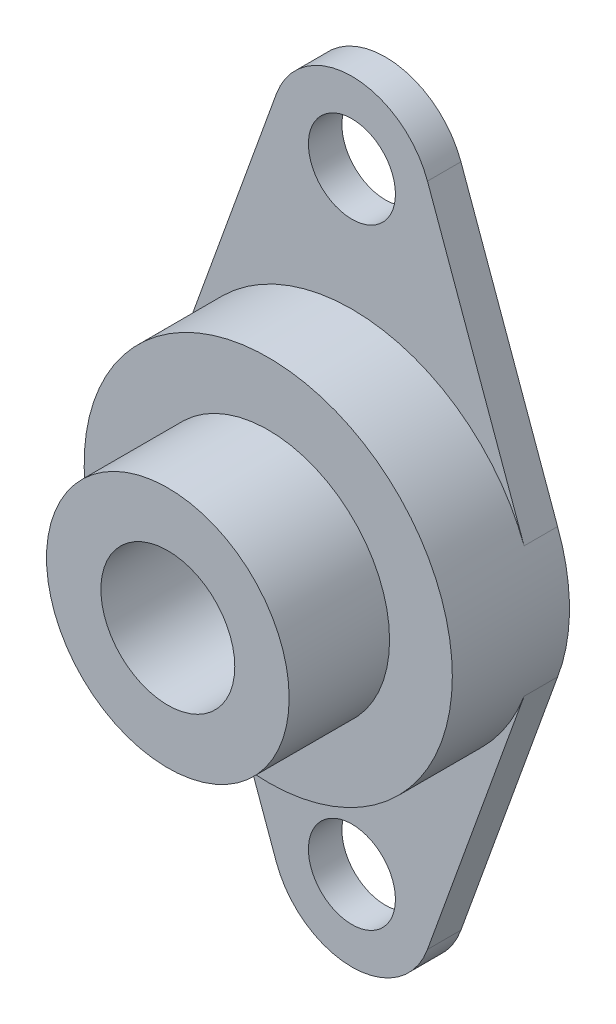
ISO-10303-21;
HEADER;
FILE_DESCRIPTION(('STEP AP214'),'2;1');
FILE_NAME('part.step','',(''),(''),'','','');
FILE_SCHEMA(('AUTOMOTIVE_DESIGN { 1 0 10303 214 1 1 1 1 }'));
ENDSEC;
DATA;
#1=APPLICATION_CONTEXT('core data for automotive mechanical design processes');
#2=APPLICATION_PROTOCOL_DEFINITION('international standard','automotive_design',2000,#1);
#3=PRODUCT_CONTEXT('',#1,'mechanical');
#4=PRODUCT('Part','Part','',(#3));
#5=PRODUCT_RELATED_PRODUCT_CATEGORY('part','',(#4));
#6=PRODUCT_DEFINITION_FORMATION('','',#4);
#7=PRODUCT_DEFINITION_CONTEXT('part definition',#1,'design');
#8=PRODUCT_DEFINITION('design','',#6,#7);
#9=PRODUCT_DEFINITION_SHAPE('','',#8);
#10=(LENGTH_UNIT() NAMED_UNIT(*) SI_UNIT(.MILLI.,.METRE.));
#11=(NAMED_UNIT(*) PLANE_ANGLE_UNIT() SI_UNIT($,.RADIAN.));
#12=(NAMED_UNIT(*) SI_UNIT($,.STERADIAN.) SOLID_ANGLE_UNIT());
#13=UNCERTAINTY_MEASURE_WITH_UNIT(LENGTH_MEASURE(1.E-05),#10,'distance_accuracy_value','');
#14=(GEOMETRIC_REPRESENTATION_CONTEXT(3) GLOBAL_UNCERTAINTY_ASSIGNED_CONTEXT((#13)) GLOBAL_UNIT_ASSIGNED_CONTEXT((#10,
#11,#12)) REPRESENTATION_CONTEXT('',''));
#15=CARTESIAN_POINT('',(0.,0.,0.));
#16=DIRECTION('',(0.,0.,1.));
#17=DIRECTION('',(1.,0.,0.));
#18=AXIS2_PLACEMENT_3D('',#15,#16,#17);
#19=CARTESIAN_POINT('',(0.,0.,7.));
#20=DIRECTION('',(0.,0.,1.));
#21=DIRECTION('',(1.,0.,0.));
#22=AXIS2_PLACEMENT_3D('',#19,#20,#21);
#23=PLANE('',#22);
#24=CARTESIAN_POINT('',(0.,0.,7.));
#25=DIRECTION('',(0.,0.,1.));
#26=DIRECTION('',(1.,0.,0.));
#27=AXIS2_PLACEMENT_3D('',#24,#25,#26);
#28=CIRCLE('',#27,11.);
#29=CARTESIAN_POINT('',(11.,0.,7.));
#30=VERTEX_POINT('',#29);
#31=EDGE_CURVE('E172',#30,#30,#28,.T.);
#32=ORIENTED_EDGE('',*,*,#31,.T.);
#33=EDGE_LOOP('',(#32));
#34=FACE_BOUND('',#33,.T.);
#35=CARTESIAN_POINT('',(0.,0.,7.));
#36=DIRECTION('',(0.,0.,1.));
#37=DIRECTION('',(1.,0.,0.));
#38=AXIS2_PLACEMENT_3D('',#35,#36,#37);
#39=CIRCLE('',#38,7.25);
#40=CARTESIAN_POINT('',(7.25,0.,7.));
#41=VERTEX_POINT('',#40);
#42=EDGE_CURVE('E207',#41,#41,#39,.T.);
#43=ORIENTED_EDGE('',*,*,#42,.F.);
#44=EDGE_LOOP('',(#43));
#45=FACE_BOUND('',#44,.T.);
#46=ADVANCED_FACE('F40',(#34,#45),#23,.T.);
#47=CARTESIAN_POINT('',(-4.51463490773956,-19.8803593621712,7.));
#48=DIRECTION('',(0.940548939112409,0.339658200452339,0.));
#49=DIRECTION('',(-0.339658200452339,0.940548939112409,0.));
#50=AXIS2_PLACEMENT_3D('',#47,#48,#49);
#51=PLANE('',#50);
#52=DIRECTION('',(0.339658200452339,-0.940548939112409,0.));
#53=VECTOR('',#52,1.);
#54=CARTESIAN_POINT('',(-10.3448740794966,-3.73581976187625,2.));
#55=LINE('',#54,#53);
#56=CARTESIAN_POINT('',(-10.2888243154293,-3.89102739726029,2.));
#57=VERTEX_POINT('',#56);
#58=CARTESIAN_POINT('',(-4.51463490773956,-19.8803593621712,2.));
#59=VERTEX_POINT('',#58);
#60=EDGE_CURVE('E198',#57,#59,#55,.T.);
#61=ORIENTED_EDGE('',*,*,#60,.F.);
#62=DIRECTION('',(0.,0.,-1.));
#63=VECTOR('',#62,1.);
#64=CARTESIAN_POINT('',(-10.2888243154293,-3.89102739726029,7.));
#65=LINE('',#64,#63);
#66=CARTESIAN_POINT('',(-10.2888243154293,-3.89102739726029,0.));
#67=VERTEX_POINT('',#66);
#68=EDGE_CURVE('E11',#57,#67,#65,.T.);
#69=ORIENTED_EDGE('',*,*,#68,.T.);
#70=DIRECTION('',(0.339658200452339,-0.940548939112409,0.));
#71=VECTOR('',#70,1.);
#72=CARTESIAN_POINT('',(-4.51463490773956,-19.8803593621712,0.));
#73=LINE('',#72,#71);
#74=CARTESIAN_POINT('',(-4.51463490773956,-19.8803593621712,0.));
#75=VERTEX_POINT('',#74);
#76=EDGE_CURVE('E149',#67,#75,#73,.T.);
#77=ORIENTED_EDGE('',*,*,#76,.T.);
#78=DIRECTION('',(0.,0.,-1.));
#79=VECTOR('',#78,1.);
#80=CARTESIAN_POINT('',(-4.51463490773956,-19.8803593621712,7.));
#81=LINE('',#80,#79);
#82=EDGE_CURVE('E48',#59,#75,#81,.T.);
#83=ORIENTED_EDGE('',*,*,#82,.F.);
#84=EDGE_LOOP('',(#61,#69,#77,#83));
#85=FACE_BOUND('',#84,.T.);
#86=ADVANCED_FACE('F42',(#85),#51,.F.);
#87=CARTESIAN_POINT('',(0.,-18.25,7.));
#88=DIRECTION('',(0.,0.,-1.));
#89=DIRECTION('',(-1.,0.,0.));
#90=AXIS2_PLACEMENT_3D('',#87,#88,#89);
#91=CYLINDRICAL_SURFACE('',#90,4.8);
#92=CARTESIAN_POINT('',(0.,-18.25,2.));
#93=DIRECTION('',(0.,0.,1.));
#94=DIRECTION('',(1.,0.,0.));
#95=AXIS2_PLACEMENT_3D('',#92,#93,#94);
#96=CIRCLE('',#95,4.8);
#97=CARTESIAN_POINT('',(4.51463490773956,-19.8803593621713,2.));
#98=VERTEX_POINT('',#97);
#99=EDGE_CURVE('E145',#59,#98,#96,.T.);
#100=ORIENTED_EDGE('',*,*,#99,.F.);
#101=ORIENTED_EDGE('',*,*,#82,.T.);
#102=CARTESIAN_POINT('',(0.,-18.25,0.));
#103=DIRECTION('',(0.,0.,1.));
#104=DIRECTION('',(-1.,0.,0.));
#105=AXIS2_PLACEMENT_3D('',#102,#103,#104);
#106=CIRCLE('',#105,4.8);
#107=CARTESIAN_POINT('',(4.51463490773956,-19.8803593621712,0.));
#108=VERTEX_POINT('',#107);
#109=EDGE_CURVE('E143',#75,#108,#106,.T.);
#110=ORIENTED_EDGE('',*,*,#109,.T.);
#111=DIRECTION('',(0.,0.,-1.));
#112=VECTOR('',#111,1.);
#113=CARTESIAN_POINT('',(4.51463490773956,-19.8803593621712,7.));
#114=LINE('',#113,#112);
#115=EDGE_CURVE('E129',#98,#108,#114,.T.);
#116=ORIENTED_EDGE('',*,*,#115,.F.);
#117=EDGE_LOOP('',(#100,#101,#110,#116));
#118=FACE_BOUND('',#117,.T.);
#119=ADVANCED_FACE('F140',(#118),#91,.T.);
#120=CARTESIAN_POINT('',(10.2888243154293,-3.89102739726029,7.));
#121=DIRECTION('',(-0.940548939112409,0.339658200452339,0.));
#122=DIRECTION('',(-0.339658200452339,-0.940548939112409,0.));
#123=AXIS2_PLACEMENT_3D('',#120,#121,#122);
#124=PLANE('',#123);
#125=DIRECTION('',(0.339658200452339,0.940548939112409,0.));
#126=VECTOR('',#125,1.);
#127=CARTESIAN_POINT('',(10.3448740794966,-3.73581976187625,2.));
#128=LINE('',#127,#126);
#129=CARTESIAN_POINT('',(10.2888243154293,-3.89102739726029,2.));
#130=VERTEX_POINT('',#129);
#131=EDGE_CURVE('E55',#98,#130,#128,.T.);
#132=ORIENTED_EDGE('',*,*,#131,.F.);
#133=ORIENTED_EDGE('',*,*,#115,.T.);
#134=DIRECTION('',(0.339658200452339,0.940548939112409,0.));
#135=VECTOR('',#134,1.);
#136=CARTESIAN_POINT('',(10.2888243154293,-3.89102739726029,0.));
#137=LINE('',#136,#135);
#138=CARTESIAN_POINT('',(10.2888243154293,-3.89102739726029,0.));
#139=VERTEX_POINT('',#138);
#140=EDGE_CURVE('E158',#108,#139,#137,.T.);
#141=ORIENTED_EDGE('',*,*,#140,.T.);
#142=DIRECTION('',(0.,0.,-1.));
#143=VECTOR('',#142,1.);
#144=CARTESIAN_POINT('',(10.2888243154293,-3.89102739726029,7.));
#145=LINE('',#144,#143);
#146=EDGE_CURVE('E127',#130,#139,#145,.T.);
#147=ORIENTED_EDGE('',*,*,#146,.F.);
#148=EDGE_LOOP('',(#132,#133,#141,#147));
#149=FACE_BOUND('',#148,.T.);
#150=ADVANCED_FACE('F251',(#149),#124,.F.);
#151=CARTESIAN_POINT('',(4.51463490773956,19.8803593621712,7.));
#152=DIRECTION('',(-0.940548939112409,-0.339658200452339,0.));
#153=DIRECTION('',(0.33965820045234,-0.940548939112409,0.));
#154=AXIS2_PLACEMENT_3D('',#151,#152,#153);
#155=PLANE('',#154);
#156=DIRECTION('',(-0.339658200452339,0.940548939112409,0.));
#157=VECTOR('',#156,1.);
#158=CARTESIAN_POINT('',(10.3448740794966,3.73581976187625,2.));
#159=LINE('',#158,#157);
#160=CARTESIAN_POINT('',(10.2888243154293,3.8910273972603,2.));
#161=VERTEX_POINT('',#160);
#162=CARTESIAN_POINT('',(4.51463490773955,19.8803593621712,2.));
#163=VERTEX_POINT('',#162);
#164=EDGE_CURVE('E106',#161,#163,#159,.T.);
#165=ORIENTED_EDGE('',*,*,#164,.F.);
#166=DIRECTION('',(0.,0.,-1.));
#167=VECTOR('',#166,1.);
#168=CARTESIAN_POINT('',(10.2888243154293,3.89102739726029,7.));
#169=LINE('',#168,#167);
#170=CARTESIAN_POINT('',(10.2888243154293,3.89102739726029,0.));
#171=VERTEX_POINT('',#170);
#172=EDGE_CURVE('E117',#161,#171,#169,.T.);
#173=ORIENTED_EDGE('',*,*,#172,.T.);
#174=DIRECTION('',(-0.339658200452339,0.940548939112409,0.));
#175=VECTOR('',#174,1.);
#176=CARTESIAN_POINT('',(4.51463490773956,19.8803593621712,0.));
#177=LINE('',#176,#175);
#178=CARTESIAN_POINT('',(4.51463490773956,19.8803593621712,0.));
#179=VERTEX_POINT('',#178);
#180=EDGE_CURVE('E164',#171,#179,#177,.T.);
#181=ORIENTED_EDGE('',*,*,#180,.T.);
#182=DIRECTION('',(0.,0.,-1.));
#183=VECTOR('',#182,1.);
#184=CARTESIAN_POINT('',(4.51463490773956,19.8803593621712,7.));
#185=LINE('',#184,#183);
#186=EDGE_CURVE('E119',#163,#179,#185,.T.);
#187=ORIENTED_EDGE('',*,*,#186,.F.);
#188=EDGE_LOOP('',(#165,#173,#181,#187));
#189=FACE_BOUND('',#188,.T.);
#190=ADVANCED_FACE('F115',(#189),#155,.F.);
#191=CARTESIAN_POINT('',(0.,18.25,7.));
#192=DIRECTION('',(0.,0.,-1.));
#193=DIRECTION('',(-1.,0.,0.));
#194=AXIS2_PLACEMENT_3D('',#191,#192,#193);
#195=CYLINDRICAL_SURFACE('',#194,4.8);
#196=CARTESIAN_POINT('',(0.,18.25,2.));
#197=DIRECTION('',(0.,0.,1.));
#198=DIRECTION('',(1.,0.,0.));
#199=AXIS2_PLACEMENT_3D('',#196,#197,#198);
#200=CIRCLE('',#199,4.8);
#201=CARTESIAN_POINT('',(-4.51463490773957,19.8803593621712,2.));
#202=VERTEX_POINT('',#201);
#203=EDGE_CURVE('E63',#163,#202,#200,.T.);
#204=ORIENTED_EDGE('',*,*,#203,.F.);
#205=ORIENTED_EDGE('',*,*,#186,.T.);
#206=CARTESIAN_POINT('',(0.,18.25,0.));
#207=DIRECTION('',(0.,0.,1.));
#208=DIRECTION('',(1.,0.,0.));
#209=AXIS2_PLACEMENT_3D('',#206,#207,#208);
#210=CIRCLE('',#209,4.8);
#211=CARTESIAN_POINT('',(-4.51463490773957,19.8803593621712,0.));
#212=VERTEX_POINT('',#211);
#213=EDGE_CURVE('E166',#179,#212,#210,.T.);
#214=ORIENTED_EDGE('',*,*,#213,.T.);
#215=DIRECTION('',(0.,0.,-1.));
#216=VECTOR('',#215,1.);
#217=CARTESIAN_POINT('',(-4.51463490773957,19.8803593621712,7.));
#218=LINE('',#217,#216);
#219=EDGE_CURVE('E131',#202,#212,#218,.T.);
#220=ORIENTED_EDGE('',*,*,#219,.F.);
#221=EDGE_LOOP('',(#204,#205,#214,#220));
#222=FACE_BOUND('',#221,.T.);
#223=ADVANCED_FACE('F180',(#222),#195,.T.);
#224=CARTESIAN_POINT('',(-4.51463490773956,19.8803593621712,7.));
#225=DIRECTION('',(0.940548939112409,-0.339658200452339,0.));
#226=DIRECTION('',(0.33965820045234,0.940548939112409,0.));
#227=AXIS2_PLACEMENT_3D('',#224,#225,#226);
#228=PLANE('',#227);
#229=DIRECTION('',(-0.339658200452339,-0.940548939112409,0.));
#230=VECTOR('',#229,1.);
#231=CARTESIAN_POINT('',(-10.3448740794966,3.73581976187625,2.));
#232=LINE('',#231,#230);
#233=CARTESIAN_POINT('',(-10.2888243154293,3.8910273972603,2.));
#234=VERTEX_POINT('',#233);
#235=EDGE_CURVE('E107',#202,#234,#232,.T.);
#236=ORIENTED_EDGE('',*,*,#235,.F.);
#237=ORIENTED_EDGE('',*,*,#219,.T.);
#238=DIRECTION('',(-0.339658200452339,-0.940548939112409,0.));
#239=VECTOR('',#238,1.);
#240=CARTESIAN_POINT('',(-4.51463490773956,19.8803593621712,0.));
#241=LINE('',#240,#239);
#242=CARTESIAN_POINT('',(-10.2888243154293,3.89102739726029,0.));
#243=VERTEX_POINT('',#242);
#244=EDGE_CURVE('E169',#212,#243,#241,.T.);
#245=ORIENTED_EDGE('',*,*,#244,.T.);
#246=DIRECTION('',(0.,0.,-1.));
#247=VECTOR('',#246,1.);
#248=CARTESIAN_POINT('',(-10.2888243154293,3.89102739726029,7.));
#249=LINE('',#248,#247);
#250=EDGE_CURVE('E173',#234,#243,#249,.T.);
#251=ORIENTED_EDGE('',*,*,#250,.F.);
#252=EDGE_LOOP('',(#236,#237,#245,#251));
#253=FACE_BOUND('',#252,.T.);
#254=ADVANCED_FACE('F176',(#253),#228,.F.);
#255=CARTESIAN_POINT('',(0.,-18.25,7.));
#256=DIRECTION('',(0.,0.,-1.));
#257=DIRECTION('',(-1.,0.,0.));
#258=AXIS2_PLACEMENT_3D('',#255,#256,#257);
#259=CYLINDRICAL_SURFACE('',#258,2.6);
#260=CARTESIAN_POINT('',(0.,-18.25,0.));
#261=DIRECTION('',(0.,0.,1.));
#262=DIRECTION('',(1.,0.,0.));
#263=AXIS2_PLACEMENT_3D('',#260,#261,#262);
#264=CIRCLE('',#263,2.6);
#265=CARTESIAN_POINT('',(2.6,-18.25,0.));
#266=VERTEX_POINT('',#265);
#267=EDGE_CURVE('E183',#266,#266,#264,.T.);
#268=ORIENTED_EDGE('',*,*,#267,.F.);
#269=EDGE_LOOP('',(#268));
#270=FACE_BOUND('',#269,.T.);
#271=CARTESIAN_POINT('',(0.,-18.25,2.));
#272=DIRECTION('',(0.,0.,1.));
#273=DIRECTION('',(1.,0.,0.));
#274=AXIS2_PLACEMENT_3D('',#271,#272,#273);
#275=CIRCLE('',#274,2.6);
#276=CARTESIAN_POINT('',(2.6,-18.25,2.));
#277=VERTEX_POINT('',#276);
#278=EDGE_CURVE('E111',#277,#277,#275,.F.);
#279=ORIENTED_EDGE('',*,*,#278,.F.);
#280=EDGE_LOOP('',(#279));
#281=FACE_BOUND('',#280,.T.);
#282=ADVANCED_FACE('F246',(#270,#281),#259,.F.);
#283=CARTESIAN_POINT('',(0.,18.25,7.));
#284=DIRECTION('',(0.,0.,-1.));
#285=DIRECTION('',(-1.,0.,0.));
#286=AXIS2_PLACEMENT_3D('',#283,#284,#285);
#287=CYLINDRICAL_SURFACE('',#286,2.6);
#288=CARTESIAN_POINT('',(0.,18.25,0.));
#289=DIRECTION('',(0.,0.,1.));
#290=DIRECTION('',(1.,0.,0.));
#291=AXIS2_PLACEMENT_3D('',#288,#289,#290);
#292=CIRCLE('',#291,2.6);
#293=CARTESIAN_POINT('',(2.59999999999999,18.25,0.));
#294=VERTEX_POINT('',#293);
#295=EDGE_CURVE('E190',#294,#294,#292,.T.);
#296=ORIENTED_EDGE('',*,*,#295,.F.);
#297=EDGE_LOOP('',(#296));
#298=FACE_BOUND('',#297,.T.);
#299=CARTESIAN_POINT('',(0.,18.25,2.));
#300=DIRECTION('',(0.,0.,1.));
#301=DIRECTION('',(1.,0.,0.));
#302=AXIS2_PLACEMENT_3D('',#299,#300,#301);
#303=CIRCLE('',#302,2.6);
#304=CARTESIAN_POINT('',(2.59999999999999,18.25,2.));
#305=VERTEX_POINT('',#304);
#306=EDGE_CURVE('E193',#305,#305,#303,.F.);
#307=ORIENTED_EDGE('',*,*,#306,.F.);
#308=EDGE_LOOP('',(#307));
#309=FACE_BOUND('',#308,.T.);
#310=ADVANCED_FACE('F243',(#298,#309),#287,.F.);
#311=CARTESIAN_POINT('',(0.,0.,0.));
#312=DIRECTION('',(0.,0.,1.));
#313=DIRECTION('',(1.,0.,0.));
#314=AXIS2_PLACEMENT_3D('',#311,#312,#313);
#315=PLANE('',#314);
#316=CARTESIAN_POINT('',(0.,0.,0.));
#317=DIRECTION('',(0.,0.,1.));
#318=DIRECTION('',(1.,0.,0.));
#319=AXIS2_PLACEMENT_3D('',#316,#317,#318);
#320=CIRCLE('',#319,11.);
#321=EDGE_CURVE('E153',#243,#67,#320,.T.);
#322=ORIENTED_EDGE('',*,*,#321,.F.);
#323=ORIENTED_EDGE('',*,*,#244,.F.);
#324=ORIENTED_EDGE('',*,*,#213,.F.);
#325=ORIENTED_EDGE('',*,*,#180,.F.);
#326=CARTESIAN_POINT('',(0.,0.,0.));
#327=DIRECTION('',(0.,0.,1.));
#328=DIRECTION('',(1.,0.,0.));
#329=AXIS2_PLACEMENT_3D('',#326,#327,#328);
#330=CIRCLE('',#329,11.);
#331=EDGE_CURVE('E125',#139,#171,#330,.T.);
#332=ORIENTED_EDGE('',*,*,#331,.F.);
#333=ORIENTED_EDGE('',*,*,#140,.F.);
#334=ORIENTED_EDGE('',*,*,#109,.F.);
#335=ORIENTED_EDGE('',*,*,#76,.F.);
#336=EDGE_LOOP('',(#322,#323,#324,#325,#332,#333,#334,#335));
#337=FACE_BOUND('',#336,.T.);
#338=CARTESIAN_POINT('',(0.,0.,0.));
#339=DIRECTION('',(0.,0.,1.));
#340=DIRECTION('',(1.,0.,0.));
#341=AXIS2_PLACEMENT_3D('',#338,#339,#340);
#342=CIRCLE('',#341,4.);
#343=CARTESIAN_POINT('',(4.,0.,0.));
#344=VERTEX_POINT('',#343);
#345=EDGE_CURVE('E181',#344,#344,#342,.T.);
#346=ORIENTED_EDGE('',*,*,#345,.T.);
#347=EDGE_LOOP('',(#346));
#348=FACE_BOUND('',#347,.T.);
#349=ORIENTED_EDGE('',*,*,#267,.T.);
#350=EDGE_LOOP('',(#349));
#351=FACE_BOUND('',#350,.T.);
#352=ORIENTED_EDGE('',*,*,#295,.T.);
#353=EDGE_LOOP('',(#352));
#354=FACE_BOUND('',#353,.T.);
#355=ADVANCED_FACE('F155',(#337,#348,#351,#354),#315,.F.);
#356=CARTESIAN_POINT('',(0.,0.,7.));
#357=DIRECTION('',(0.,0.,-1.));
#358=DIRECTION('',(-1.,0.,0.));
#359=AXIS2_PLACEMENT_3D('',#356,#357,#358);
#360=CYLINDRICAL_SURFACE('',#359,11.);
#361=ORIENTED_EDGE('',*,*,#68,.F.);
#362=CARTESIAN_POINT('',(0.,0.,2.));
#363=DIRECTION('',(0.,0.,1.));
#364=DIRECTION('',(1.,0.,0.));
#365=AXIS2_PLACEMENT_3D('',#362,#363,#364);
#366=CIRCLE('',#365,11.);
#367=EDGE_CURVE('E200',#57,#130,#366,.T.);
#368=ORIENTED_EDGE('',*,*,#367,.T.);
#369=ORIENTED_EDGE('',*,*,#146,.T.);
#370=ORIENTED_EDGE('',*,*,#331,.T.);
#371=ORIENTED_EDGE('',*,*,#172,.F.);
#372=CARTESIAN_POINT('',(0.,0.,2.));
#373=DIRECTION('',(0.,0.,1.));
#374=DIRECTION('',(1.,0.,0.));
#375=AXIS2_PLACEMENT_3D('',#372,#373,#374);
#376=CIRCLE('',#375,11.);
#377=EDGE_CURVE('E102',#161,#234,#376,.T.);
#378=ORIENTED_EDGE('',*,*,#377,.T.);
#379=ORIENTED_EDGE('',*,*,#250,.T.);
#380=ORIENTED_EDGE('',*,*,#321,.T.);
#381=EDGE_LOOP('',(#361,#368,#369,#370,#371,#378,#379,#380));
#382=FACE_BOUND('',#381,.T.);
#383=ORIENTED_EDGE('',*,*,#31,.F.);
#384=EDGE_LOOP('',(#383));
#385=FACE_BOUND('',#384,.T.);
#386=ADVANCED_FACE('F122',(#382,#385),#360,.T.);
#387=CARTESIAN_POINT('',(0.,0.,7.));
#388=DIRECTION('',(0.,0.,-1.));
#389=DIRECTION('',(-1.,0.,0.));
#390=AXIS2_PLACEMENT_3D('',#387,#388,#389);
#391=CYLINDRICAL_SURFACE('',#390,4.);
#392=ORIENTED_EDGE('',*,*,#345,.F.);
#393=EDGE_LOOP('',(#392));
#394=FACE_BOUND('',#393,.T.);
#395=CARTESIAN_POINT('',(0.,0.,13.));
#396=DIRECTION('',(0.,0.,1.));
#397=DIRECTION('',(1.,0.,0.));
#398=AXIS2_PLACEMENT_3D('',#395,#396,#397);
#399=CIRCLE('',#398,4.);
#400=CARTESIAN_POINT('',(4.,0.,13.));
#401=VERTEX_POINT('',#400);
#402=EDGE_CURVE('E210',#401,#401,#399,.T.);
#403=ORIENTED_EDGE('',*,*,#402,.T.);
#404=EDGE_LOOP('',(#403));
#405=FACE_BOUND('',#404,.T.);
#406=ADVANCED_FACE('F216',(#394,#405),#391,.F.);
#407=CARTESIAN_POINT('',(0.,0.,2.));
#408=DIRECTION('',(0.,0.,1.));
#409=DIRECTION('',(1.,0.,0.));
#410=AXIS2_PLACEMENT_3D('',#407,#408,#409);
#411=PLANE('',#410);
#412=ORIENTED_EDGE('',*,*,#377,.F.);
#413=ORIENTED_EDGE('',*,*,#164,.T.);
#414=ORIENTED_EDGE('',*,*,#203,.T.);
#415=ORIENTED_EDGE('',*,*,#235,.T.);
#416=EDGE_LOOP('',(#412,#413,#414,#415));
#417=FACE_BOUND('',#416,.T.);
#418=ORIENTED_EDGE('',*,*,#306,.T.);
#419=EDGE_LOOP('',(#418));
#420=FACE_BOUND('',#419,.T.);
#421=ADVANCED_FACE('F104',(#417,#420),#411,.T.);
#422=CARTESIAN_POINT('',(0.,0.,2.));
#423=DIRECTION('',(0.,0.,1.));
#424=DIRECTION('',(1.,0.,0.));
#425=AXIS2_PLACEMENT_3D('',#422,#423,#424);
#426=PLANE('',#425);
#427=ORIENTED_EDGE('',*,*,#367,.F.);
#428=ORIENTED_EDGE('',*,*,#60,.T.);
#429=ORIENTED_EDGE('',*,*,#99,.T.);
#430=ORIENTED_EDGE('',*,*,#131,.T.);
#431=EDGE_LOOP('',(#427,#428,#429,#430));
#432=FACE_BOUND('',#431,.T.);
#433=ORIENTED_EDGE('',*,*,#278,.T.);
#434=EDGE_LOOP('',(#433));
#435=FACE_BOUND('',#434,.T.);
#436=ADVANCED_FACE('F221',(#432,#435),#426,.T.);
#437=CARTESIAN_POINT('',(0.,0.,13.));
#438=DIRECTION('',(0.,0.,1.));
#439=DIRECTION('',(1.,0.,0.));
#440=AXIS2_PLACEMENT_3D('',#437,#438,#439);
#441=PLANE('',#440);
#442=CARTESIAN_POINT('',(0.,0.,13.));
#443=DIRECTION('',(0.,0.,1.));
#444=DIRECTION('',(1.,0.,0.));
#445=AXIS2_PLACEMENT_3D('',#442,#443,#444);
#446=CIRCLE('',#445,7.25);
#447=CARTESIAN_POINT('',(7.25,0.,13.));
#448=VERTEX_POINT('',#447);
#449=EDGE_CURVE('E202',#448,#448,#446,.T.);
#450=ORIENTED_EDGE('',*,*,#449,.T.);
#451=EDGE_LOOP('',(#450));
#452=FACE_BOUND('',#451,.T.);
#453=ORIENTED_EDGE('',*,*,#402,.F.);
#454=EDGE_LOOP('',(#453));
#455=FACE_BOUND('',#454,.T.);
#456=ADVANCED_FACE('F218',(#452,#455),#441,.T.);
#457=CARTESIAN_POINT('',(0.,0.,13.));
#458=DIRECTION('',(0.,0.,-1.));
#459=DIRECTION('',(-1.,0.,0.));
#460=AXIS2_PLACEMENT_3D('',#457,#458,#459);
#461=CYLINDRICAL_SURFACE('',#460,7.25);
#462=ORIENTED_EDGE('',*,*,#449,.F.);
#463=EDGE_LOOP('',(#462));
#464=FACE_BOUND('',#463,.T.);
#465=ORIENTED_EDGE('',*,*,#42,.T.);
#466=EDGE_LOOP('',(#465));
#467=FACE_BOUND('',#466,.T.);
#468=ADVANCED_FACE('F220',(#464,#467),#461,.T.);
#469=CLOSED_SHELL('',(#46,#86,#119,#150,#190,#223,#254,#282,#310,#355,#386,#406,#421,#436,#456,#468));
#470=MANIFOLD_SOLID_BREP('B2',#469);
#471=ADVANCED_BREP_SHAPE_REPRESENTATION('',(#18,#470),#14);
#472=SHAPE_DEFINITION_REPRESENTATION(#9,#471);
ENDSEC;
END-ISO-10303-21;
